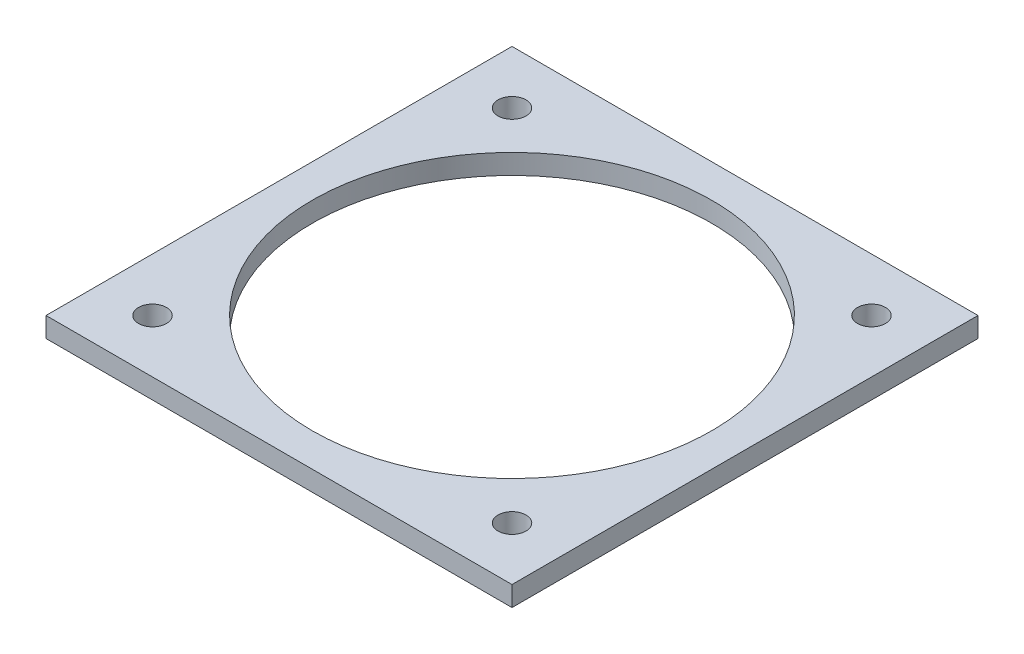
ISO-10303-21;
HEADER;
FILE_DESCRIPTION(('STEP AP214'),'2;1');
FILE_NAME('part.step','',(''),(''),'','','');
FILE_SCHEMA(('AUTOMOTIVE_DESIGN { 1 0 10303 214 1 1 1 1 }'));
ENDSEC;
DATA;
#1=APPLICATION_CONTEXT('core data for automotive mechanical design processes');
#2=APPLICATION_PROTOCOL_DEFINITION('international standard','automotive_design',2000,#1);
#3=PRODUCT_CONTEXT('',#1,'mechanical');
#4=PRODUCT('Part','Part','',(#3));
#5=PRODUCT_RELATED_PRODUCT_CATEGORY('part','',(#4));
#6=PRODUCT_DEFINITION_FORMATION('','',#4);
#7=PRODUCT_DEFINITION_CONTEXT('part definition',#1,'design');
#8=PRODUCT_DEFINITION('design','',#6,#7);
#9=PRODUCT_DEFINITION_SHAPE('','',#8);
#10=(LENGTH_UNIT() NAMED_UNIT(*) SI_UNIT(.MILLI.,.METRE.));
#11=(NAMED_UNIT(*) PLANE_ANGLE_UNIT() SI_UNIT($,.RADIAN.));
#12=(NAMED_UNIT(*) SI_UNIT($,.STERADIAN.) SOLID_ANGLE_UNIT());
#13=UNCERTAINTY_MEASURE_WITH_UNIT(LENGTH_MEASURE(1.E-05),#10,'distance_accuracy_value','');
#14=(GEOMETRIC_REPRESENTATION_CONTEXT(3) GLOBAL_UNCERTAINTY_ASSIGNED_CONTEXT((#13)) GLOBAL_UNIT_ASSIGNED_CONTEXT((#10,
#11,#12)) REPRESENTATION_CONTEXT('',''));
#15=CARTESIAN_POINT('',(0.,0.,0.));
#16=DIRECTION('',(0.,0.,1.));
#17=DIRECTION('',(1.,0.,0.));
#18=AXIS2_PLACEMENT_3D('',#15,#16,#17);
#19=CARTESIAN_POINT('',(0.,3.,0.));
#20=DIRECTION('',(0.,-1.,0.));
#21=DIRECTION('',(0.,0.,-1.));
#22=AXIS2_PLACEMENT_3D('',#19,#20,#21);
#23=PLANE('',#22);
#24=CARTESIAN_POINT('',(26.9999999999999,3.,27.0000000000001));
#25=DIRECTION('',(0.,1.,0.));
#26=DIRECTION('',(-1.,0.,0.));
#27=AXIS2_PLACEMENT_3D('',#24,#25,#26);
#28=CIRCLE('',#27,2.1);
#29=CARTESIAN_POINT('',(24.8999999999999,3.,27.0000000000001));
#30=VERTEX_POINT('',#29);
#31=EDGE_CURVE('E127',#30,#30,#28,.T.);
#32=ORIENTED_EDGE('',*,*,#31,.F.);
#33=EDGE_LOOP('',(#32));
#34=FACE_BOUND('',#33,.T.);
#35=CARTESIAN_POINT('',(-27.,3.,27.));
#36=DIRECTION('',(0.,1.,0.));
#37=DIRECTION('',(0.,0.,-1.));
#38=AXIS2_PLACEMENT_3D('',#35,#36,#37);
#39=CIRCLE('',#38,2.1);
#40=CARTESIAN_POINT('',(-27.,3.,24.9));
#41=VERTEX_POINT('',#40);
#42=EDGE_CURVE('E225',#41,#41,#39,.T.);
#43=ORIENTED_EDGE('',*,*,#42,.F.);
#44=EDGE_LOOP('',(#43));
#45=FACE_BOUND('',#44,.T.);
#46=CARTESIAN_POINT('',(-26.9999999999997,3.,-27.0000000000003));
#47=DIRECTION('',(0.,1.,0.));
#48=DIRECTION('',(1.,0.,0.));
#49=AXIS2_PLACEMENT_3D('',#46,#47,#48);
#50=CIRCLE('',#49,2.1);
#51=CARTESIAN_POINT('',(-24.8999999999997,3.,-27.0000000000003));
#52=VERTEX_POINT('',#51);
#53=EDGE_CURVE('E140',#52,#52,#50,.T.);
#54=ORIENTED_EDGE('',*,*,#53,.F.);
#55=EDGE_LOOP('',(#54));
#56=FACE_BOUND('',#55,.T.);
#57=CARTESIAN_POINT('',(27.,3.,-27.));
#58=DIRECTION('',(0.,1.,0.));
#59=DIRECTION('',(0.,0.,1.));
#60=AXIS2_PLACEMENT_3D('',#57,#58,#59);
#61=CIRCLE('',#60,2.1);
#62=CARTESIAN_POINT('',(27.,3.,-24.9));
#63=VERTEX_POINT('',#62);
#64=EDGE_CURVE('E123',#63,#63,#61,.T.);
#65=ORIENTED_EDGE('',*,*,#64,.F.);
#66=EDGE_LOOP('',(#65));
#67=FACE_BOUND('',#66,.T.);
#68=DIRECTION('',(0.,0.,-1.));
#69=VECTOR('',#68,1.);
#70=CARTESIAN_POINT('',(35.,3.,35.));
#71=LINE('',#70,#69);
#72=CARTESIAN_POINT('',(35.,3.,35.));
#73=VERTEX_POINT('',#72);
#74=CARTESIAN_POINT('',(35.,3.,-35.));
#75=VERTEX_POINT('',#74);
#76=EDGE_CURVE('E97',#73,#75,#71,.T.);
#77=ORIENTED_EDGE('',*,*,#76,.T.);
#78=DIRECTION('',(-1.,0.,0.));
#79=VECTOR('',#78,1.);
#80=CARTESIAN_POINT('',(-35.,3.,-35.));
#81=LINE('',#80,#79);
#82=CARTESIAN_POINT('',(-35.,3.,-35.));
#83=VERTEX_POINT('',#82);
#84=EDGE_CURVE('E92',#75,#83,#81,.T.);
#85=ORIENTED_EDGE('',*,*,#84,.T.);
#86=DIRECTION('',(0.,0.,1.));
#87=VECTOR('',#86,1.);
#88=CARTESIAN_POINT('',(-35.,3.,35.));
#89=LINE('',#88,#87);
#90=CARTESIAN_POINT('',(-35.,3.,35.));
#91=VERTEX_POINT('',#90);
#92=EDGE_CURVE('E95',#83,#91,#89,.T.);
#93=ORIENTED_EDGE('',*,*,#92,.T.);
#94=DIRECTION('',(1.,0.,0.));
#95=VECTOR('',#94,1.);
#96=CARTESIAN_POINT('',(-35.,3.,35.));
#97=LINE('',#96,#95);
#98=EDGE_CURVE('E62',#91,#73,#97,.T.);
#99=ORIENTED_EDGE('',*,*,#98,.T.);
#100=EDGE_LOOP('',(#77,#85,#93,#99));
#101=FACE_BOUND('',#100,.T.);
#102=CARTESIAN_POINT('',(0.,3.,0.));
#103=DIRECTION('',(0.,1.,0.));
#104=DIRECTION('',(0.,0.,1.));
#105=AXIS2_PLACEMENT_3D('',#102,#103,#104);
#106=CIRCLE('',#105,30.);
#107=CARTESIAN_POINT('',(0.,3.,30.));
#108=VERTEX_POINT('',#107);
#109=EDGE_CURVE('E113',#108,#108,#106,.T.);
#110=ORIENTED_EDGE('',*,*,#109,.F.);
#111=EDGE_LOOP('',(#110));
#112=FACE_BOUND('',#111,.T.);
#113=ADVANCED_FACE('F43',(#34,#45,#56,#67,#101,#112),#23,.F.);
#114=CARTESIAN_POINT('',(0.,0.,0.));
#115=DIRECTION('',(0.,-1.,0.));
#116=DIRECTION('',(0.,0.,-1.));
#117=AXIS2_PLACEMENT_3D('',#114,#115,#116);
#118=PLANE('',#117);
#119=CARTESIAN_POINT('',(26.9999999999999,0.,27.0000000000001));
#120=DIRECTION('',(0.,-1.,0.));
#121=DIRECTION('',(0.,0.,-1.));
#122=AXIS2_PLACEMENT_3D('',#119,#120,#121);
#123=CIRCLE('',#122,2.1);
#124=CARTESIAN_POINT('',(26.9999999999999,0.,24.9000000000001));
#125=VERTEX_POINT('',#124);
#126=EDGE_CURVE('E47',#125,#125,#123,.T.);
#127=ORIENTED_EDGE('',*,*,#126,.F.);
#128=EDGE_LOOP('',(#127));
#129=FACE_BOUND('',#128,.T.);
#130=CARTESIAN_POINT('',(-27.,0.,27.));
#131=DIRECTION('',(0.,-1.,0.));
#132=DIRECTION('',(0.,0.,-1.));
#133=AXIS2_PLACEMENT_3D('',#130,#131,#132);
#134=CIRCLE('',#133,2.1);
#135=CARTESIAN_POINT('',(-27.,0.,24.9));
#136=VERTEX_POINT('',#135);
#137=EDGE_CURVE('E126',#136,#136,#134,.T.);
#138=ORIENTED_EDGE('',*,*,#137,.F.);
#139=EDGE_LOOP('',(#138));
#140=FACE_BOUND('',#139,.T.);
#141=CARTESIAN_POINT('',(-26.9999999999997,0.,-27.0000000000003));
#142=DIRECTION('',(0.,-1.,0.));
#143=DIRECTION('',(0.,0.,-1.));
#144=AXIS2_PLACEMENT_3D('',#141,#142,#143);
#145=CIRCLE('',#144,2.1);
#146=CARTESIAN_POINT('',(-26.9999999999997,0.,-29.1000000000003));
#147=VERTEX_POINT('',#146);
#148=EDGE_CURVE('E124',#147,#147,#145,.T.);
#149=ORIENTED_EDGE('',*,*,#148,.F.);
#150=EDGE_LOOP('',(#149));
#151=FACE_BOUND('',#150,.T.);
#152=CARTESIAN_POINT('',(27.,0.,-27.));
#153=DIRECTION('',(0.,-1.,0.));
#154=DIRECTION('',(0.,0.,-1.));
#155=AXIS2_PLACEMENT_3D('',#152,#153,#154);
#156=CIRCLE('',#155,2.1);
#157=CARTESIAN_POINT('',(27.,0.,-29.1));
#158=VERTEX_POINT('',#157);
#159=EDGE_CURVE('E119',#158,#158,#156,.T.);
#160=ORIENTED_EDGE('',*,*,#159,.F.);
#161=EDGE_LOOP('',(#160));
#162=FACE_BOUND('',#161,.T.);
#163=DIRECTION('',(0.,0.,-1.));
#164=VECTOR('',#163,1.);
#165=CARTESIAN_POINT('',(35.,0.,35.));
#166=LINE('',#165,#164);
#167=CARTESIAN_POINT('',(35.,0.,35.));
#168=VERTEX_POINT('',#167);
#169=CARTESIAN_POINT('',(35.,0.,-35.));
#170=VERTEX_POINT('',#169);
#171=EDGE_CURVE('E110',#168,#170,#166,.T.);
#172=ORIENTED_EDGE('',*,*,#171,.F.);
#173=DIRECTION('',(1.,0.,0.));
#174=VECTOR('',#173,1.);
#175=CARTESIAN_POINT('',(-35.,0.,35.));
#176=LINE('',#175,#174);
#177=CARTESIAN_POINT('',(-35.,0.,35.));
#178=VERTEX_POINT('',#177);
#179=EDGE_CURVE('E85',#178,#168,#176,.T.);
#180=ORIENTED_EDGE('',*,*,#179,.F.);
#181=DIRECTION('',(0.,0.,1.));
#182=VECTOR('',#181,1.);
#183=CARTESIAN_POINT('',(-35.,0.,35.));
#184=LINE('',#183,#182);
#185=CARTESIAN_POINT('',(-35.,0.,-35.));
#186=VERTEX_POINT('',#185);
#187=EDGE_CURVE('E79',#186,#178,#184,.T.);
#188=ORIENTED_EDGE('',*,*,#187,.F.);
#189=DIRECTION('',(-1.,0.,0.));
#190=VECTOR('',#189,1.);
#191=CARTESIAN_POINT('',(-35.,0.,-35.));
#192=LINE('',#191,#190);
#193=EDGE_CURVE('E101',#170,#186,#192,.T.);
#194=ORIENTED_EDGE('',*,*,#193,.F.);
#195=EDGE_LOOP('',(#172,#180,#188,#194));
#196=FACE_BOUND('',#195,.T.);
#197=CARTESIAN_POINT('',(0.,0.,0.));
#198=DIRECTION('',(0.,1.,0.));
#199=DIRECTION('',(0.,0.,1.));
#200=AXIS2_PLACEMENT_3D('',#197,#198,#199);
#201=CIRCLE('',#200,30.);
#202=CARTESIAN_POINT('',(0.,0.,30.));
#203=VERTEX_POINT('',#202);
#204=EDGE_CURVE('E122',#203,#203,#201,.T.);
#205=ORIENTED_EDGE('',*,*,#204,.T.);
#206=EDGE_LOOP('',(#205));
#207=FACE_BOUND('',#206,.T.);
#208=ADVANCED_FACE('F147',(#129,#140,#151,#162,#196,#207),#118,.T.);
#209=CARTESIAN_POINT('',(35.,3.,35.));
#210=DIRECTION('',(-1.,0.,0.));
#211=DIRECTION('',(0.,0.,1.));
#212=AXIS2_PLACEMENT_3D('',#209,#210,#211);
#213=PLANE('',#212);
#214=ORIENTED_EDGE('',*,*,#171,.T.);
#215=DIRECTION('',(0.,-1.,0.));
#216=VECTOR('',#215,1.);
#217=CARTESIAN_POINT('',(35.,3.,-35.));
#218=LINE('',#217,#216);
#219=EDGE_CURVE('E11',#75,#170,#218,.T.);
#220=ORIENTED_EDGE('',*,*,#219,.F.);
#221=ORIENTED_EDGE('',*,*,#76,.F.);
#222=DIRECTION('',(0.,-1.,0.));
#223=VECTOR('',#222,1.);
#224=CARTESIAN_POINT('',(35.,3.,35.));
#225=LINE('',#224,#223);
#226=EDGE_CURVE('E106',#73,#168,#225,.T.);
#227=ORIENTED_EDGE('',*,*,#226,.T.);
#228=EDGE_LOOP('',(#214,#220,#221,#227));
#229=FACE_BOUND('',#228,.T.);
#230=ADVANCED_FACE('F45',(#229),#213,.F.);
#231=CARTESIAN_POINT('',(-35.,3.,-35.));
#232=DIRECTION('',(0.,0.,1.));
#233=DIRECTION('',(1.,0.,0.));
#234=AXIS2_PLACEMENT_3D('',#231,#232,#233);
#235=PLANE('',#234);
#236=ORIENTED_EDGE('',*,*,#193,.T.);
#237=DIRECTION('',(0.,-1.,0.));
#238=VECTOR('',#237,1.);
#239=CARTESIAN_POINT('',(-35.,3.,-35.));
#240=LINE('',#239,#238);
#241=EDGE_CURVE('E53',#83,#186,#240,.T.);
#242=ORIENTED_EDGE('',*,*,#241,.F.);
#243=ORIENTED_EDGE('',*,*,#84,.F.);
#244=ORIENTED_EDGE('',*,*,#219,.T.);
#245=EDGE_LOOP('',(#236,#242,#243,#244));
#246=FACE_BOUND('',#245,.T.);
#247=ADVANCED_FACE('F100',(#246),#235,.F.);
#248=CARTESIAN_POINT('',(-35.,3.,35.));
#249=DIRECTION('',(1.,0.,0.));
#250=DIRECTION('',(0.,0.,-1.));
#251=AXIS2_PLACEMENT_3D('',#248,#249,#250);
#252=PLANE('',#251);
#253=ORIENTED_EDGE('',*,*,#187,.T.);
#254=DIRECTION('',(0.,-1.,0.));
#255=VECTOR('',#254,1.);
#256=CARTESIAN_POINT('',(-35.,3.,35.));
#257=LINE('',#256,#255);
#258=EDGE_CURVE('E102',#91,#178,#257,.T.);
#259=ORIENTED_EDGE('',*,*,#258,.F.);
#260=ORIENTED_EDGE('',*,*,#92,.F.);
#261=ORIENTED_EDGE('',*,*,#241,.T.);
#262=EDGE_LOOP('',(#253,#259,#260,#261));
#263=FACE_BOUND('',#262,.T.);
#264=ADVANCED_FACE('F104',(#263),#252,.F.);
#265=CARTESIAN_POINT('',(-35.,3.,35.));
#266=DIRECTION('',(0.,0.,-1.));
#267=DIRECTION('',(-1.,0.,0.));
#268=AXIS2_PLACEMENT_3D('',#265,#266,#267);
#269=PLANE('',#268);
#270=ORIENTED_EDGE('',*,*,#179,.T.);
#271=ORIENTED_EDGE('',*,*,#226,.F.);
#272=ORIENTED_EDGE('',*,*,#98,.F.);
#273=ORIENTED_EDGE('',*,*,#258,.T.);
#274=EDGE_LOOP('',(#270,#271,#272,#273));
#275=FACE_BOUND('',#274,.T.);
#276=ADVANCED_FACE('F152',(#275),#269,.F.);
#277=CARTESIAN_POINT('',(0.,3.,0.));
#278=DIRECTION('',(0.,-1.,0.));
#279=DIRECTION('',(0.,0.,-1.));
#280=AXIS2_PLACEMENT_3D('',#277,#278,#279);
#281=CYLINDRICAL_SURFACE('',#280,30.);
#282=ORIENTED_EDGE('',*,*,#109,.T.);
#283=EDGE_LOOP('',(#282));
#284=FACE_BOUND('',#283,.T.);
#285=ORIENTED_EDGE('',*,*,#204,.F.);
#286=EDGE_LOOP('',(#285));
#287=FACE_BOUND('',#286,.T.);
#288=ADVANCED_FACE('F149',(#284,#287),#281,.F.);
#289=CARTESIAN_POINT('',(27.,-7.,-27.));
#290=DIRECTION('',(0.,1.,0.));
#291=DIRECTION('',(0.,0.,1.));
#292=AXIS2_PLACEMENT_3D('',#289,#290,#291);
#293=CYLINDRICAL_SURFACE('',#292,2.1);
#294=ORIENTED_EDGE('',*,*,#159,.T.);
#295=EDGE_LOOP('',(#294));
#296=FACE_BOUND('',#295,.T.);
#297=ORIENTED_EDGE('',*,*,#64,.T.);
#298=EDGE_LOOP('',(#297));
#299=FACE_BOUND('',#298,.T.);
#300=ADVANCED_FACE('F151',(#296,#299),#293,.F.);
#301=CARTESIAN_POINT('',(-26.9999999999997,-7.,-27.0000000000003));
#302=DIRECTION('',(0.,1.,0.));
#303=DIRECTION('',(0.,0.,1.));
#304=AXIS2_PLACEMENT_3D('',#301,#302,#303);
#305=CYLINDRICAL_SURFACE('',#304,2.1);
#306=ORIENTED_EDGE('',*,*,#148,.T.);
#307=EDGE_LOOP('',(#306));
#308=FACE_BOUND('',#307,.T.);
#309=ORIENTED_EDGE('',*,*,#53,.T.);
#310=EDGE_LOOP('',(#309));
#311=FACE_BOUND('',#310,.T.);
#312=ADVANCED_FACE('F159',(#308,#311),#305,.F.);
#313=CARTESIAN_POINT('',(-27.,-7.,27.));
#314=DIRECTION('',(0.,1.,0.));
#315=DIRECTION('',(0.,0.,1.));
#316=AXIS2_PLACEMENT_3D('',#313,#314,#315);
#317=CYLINDRICAL_SURFACE('',#316,2.1);
#318=ORIENTED_EDGE('',*,*,#137,.T.);
#319=EDGE_LOOP('',(#318));
#320=FACE_BOUND('',#319,.T.);
#321=ORIENTED_EDGE('',*,*,#42,.T.);
#322=EDGE_LOOP('',(#321));
#323=FACE_BOUND('',#322,.T.);
#324=ADVANCED_FACE('F200',(#320,#323),#317,.F.);
#325=CARTESIAN_POINT('',(26.9999999999999,-7.,27.0000000000001));
#326=DIRECTION('',(0.,1.,0.));
#327=DIRECTION('',(0.,0.,1.));
#328=AXIS2_PLACEMENT_3D('',#325,#326,#327);
#329=CYLINDRICAL_SURFACE('',#328,2.1);
#330=ORIENTED_EDGE('',*,*,#126,.T.);
#331=EDGE_LOOP('',(#330));
#332=FACE_BOUND('',#331,.T.);
#333=ORIENTED_EDGE('',*,*,#31,.T.);
#334=EDGE_LOOP('',(#333));
#335=FACE_BOUND('',#334,.T.);
#336=ADVANCED_FACE('F211',(#332,#335),#329,.F.);
#337=CLOSED_SHELL('',(#113,#208,#230,#247,#264,#276,#288,#300,#312,#324,#336));
#338=MANIFOLD_SOLID_BREP('B2',#337);
#339=ADVANCED_BREP_SHAPE_REPRESENTATION('',(#18,#338),#14);
#340=SHAPE_DEFINITION_REPRESENTATION(#9,#339);
ENDSEC;
END-ISO-10303-21;
